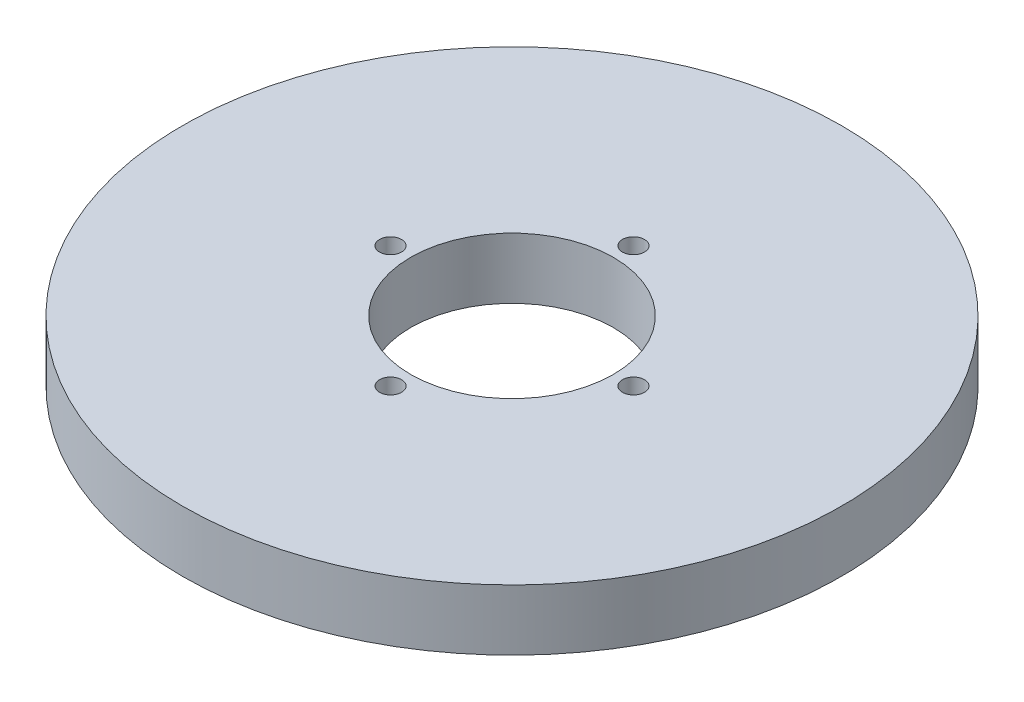
ISO-10303-21;
HEADER;
FILE_DESCRIPTION(('STEP AP214'),'2;1');
FILE_NAME('part.step','',(''),(''),'','','');
FILE_SCHEMA(('AUTOMOTIVE_DESIGN { 1 0 10303 214 1 1 1 1 }'));
ENDSEC;
DATA;
#1=APPLICATION_CONTEXT('core data for automotive mechanical design processes');
#2=APPLICATION_PROTOCOL_DEFINITION('international standard','automotive_design',2000,#1);
#3=PRODUCT_CONTEXT('',#1,'mechanical');
#4=PRODUCT('Part','Part','',(#3));
#5=PRODUCT_RELATED_PRODUCT_CATEGORY('part','',(#4));
#6=PRODUCT_DEFINITION_FORMATION('','',#4);
#7=PRODUCT_DEFINITION_CONTEXT('part definition',#1,'design');
#8=PRODUCT_DEFINITION('design','',#6,#7);
#9=PRODUCT_DEFINITION_SHAPE('','',#8);
#10=(LENGTH_UNIT() NAMED_UNIT(*) SI_UNIT(.MILLI.,.METRE.));
#11=(NAMED_UNIT(*) PLANE_ANGLE_UNIT() SI_UNIT($,.RADIAN.));
#12=(NAMED_UNIT(*) SI_UNIT($,.STERADIAN.) SOLID_ANGLE_UNIT());
#13=UNCERTAINTY_MEASURE_WITH_UNIT(LENGTH_MEASURE(1.E-05),#10,'distance_accuracy_value','');
#14=(GEOMETRIC_REPRESENTATION_CONTEXT(3) GLOBAL_UNCERTAINTY_ASSIGNED_CONTEXT((#13)) GLOBAL_UNIT_ASSIGNED_CONTEXT((#10,
#11,#12)) REPRESENTATION_CONTEXT('',''));
#15=CARTESIAN_POINT('',(0.,0.,0.));
#16=DIRECTION('',(0.,0.,1.));
#17=DIRECTION('',(1.,0.,0.));
#18=AXIS2_PLACEMENT_3D('',#15,#16,#17);
#19=CARTESIAN_POINT('',(0.,18.,0.));
#20=DIRECTION('',(0.,-1.,0.));
#21=DIRECTION('',(0.,0.,-1.));
#22=AXIS2_PLACEMENT_3D('',#19,#20,#21);
#23=CYLINDRICAL_SURFACE('',#22,97.5);
#24=CARTESIAN_POINT('',(0.,18.,0.));
#25=DIRECTION('',(0.,1.,0.));
#26=DIRECTION('',(0.,0.,1.));
#27=AXIS2_PLACEMENT_3D('',#24,#25,#26);
#28=CIRCLE('',#27,97.5);
#29=CARTESIAN_POINT('',(0.,18.,97.5));
#30=VERTEX_POINT('',#29);
#31=EDGE_CURVE('E10',#30,#30,#28,.T.);
#32=ORIENTED_EDGE('',*,*,#31,.F.);
#33=EDGE_LOOP('',(#32));
#34=FACE_BOUND('',#33,.T.);
#35=CARTESIAN_POINT('',(0.,0.,0.));
#36=DIRECTION('',(0.,1.,0.));
#37=DIRECTION('',(0.,0.,1.));
#38=AXIS2_PLACEMENT_3D('',#35,#36,#37);
#39=CIRCLE('',#38,97.5);
#40=CARTESIAN_POINT('',(0.,0.,97.5));
#41=VERTEX_POINT('',#40);
#42=EDGE_CURVE('E37',#41,#41,#39,.T.);
#43=ORIENTED_EDGE('',*,*,#42,.T.);
#44=EDGE_LOOP('',(#43));
#45=FACE_BOUND('',#44,.T.);
#46=ADVANCED_FACE('F40',(#34,#45),#23,.T.);
#47=CARTESIAN_POINT('',(0.,18.,0.));
#48=DIRECTION('',(0.,1.,0.));
#49=DIRECTION('',(0.,0.,1.));
#50=AXIS2_PLACEMENT_3D('',#47,#48,#49);
#51=PLANE('',#50);
#52=CARTESIAN_POINT('',(1.25469452952764E-13,18.,35.9358795812258));
#53=DIRECTION('',(0.,1.,0.));
#54=DIRECTION('',(1.,0.,0.));
#55=AXIS2_PLACEMENT_3D('',#52,#53,#54);
#56=CIRCLE('',#55,3.25439564108422);
#57=CARTESIAN_POINT('',(3.25439564108435,18.,35.9358795812258));
#58=VERTEX_POINT('',#57);
#59=EDGE_CURVE('E71',#58,#58,#56,.T.);
#60=ORIENTED_EDGE('',*,*,#59,.F.);
#61=EDGE_LOOP('',(#60));
#62=FACE_BOUND('',#61,.T.);
#63=CARTESIAN_POINT('',(35.9358795812258,18.,0.));
#64=DIRECTION('',(0.,1.,0.));
#65=DIRECTION('',(0.,0.,-1.));
#66=AXIS2_PLACEMENT_3D('',#63,#64,#65);
#67=CIRCLE('',#66,3.25439564108422);
#68=CARTESIAN_POINT('',(35.9358795812258,18.,-3.25439564108422));
#69=VERTEX_POINT('',#68);
#70=EDGE_CURVE('E70',#69,#69,#67,.T.);
#71=ORIENTED_EDGE('',*,*,#70,.F.);
#72=EDGE_LOOP('',(#71));
#73=FACE_BOUND('',#72,.T.);
#74=CARTESIAN_POINT('',(-3.76408358858292E-13,18.,-35.9358795812258));
#75=DIRECTION('',(0.,1.,0.));
#76=DIRECTION('',(-1.,0.,0.));
#77=AXIS2_PLACEMENT_3D('',#74,#75,#76);
#78=CIRCLE('',#77,3.25439564108422);
#79=CARTESIAN_POINT('',(-3.2543956410846,18.,-35.9358795812258));
#80=VERTEX_POINT('',#79);
#81=EDGE_CURVE('E61',#80,#80,#78,.T.);
#82=ORIENTED_EDGE('',*,*,#81,.F.);
#83=EDGE_LOOP('',(#82));
#84=FACE_BOUND('',#83,.T.);
#85=CARTESIAN_POINT('',(-35.9358795812258,18.,0.));
#86=DIRECTION('',(0.,1.,0.));
#87=DIRECTION('',(0.,0.,1.));
#88=AXIS2_PLACEMENT_3D('',#85,#86,#87);
#89=CIRCLE('',#88,3.25439564108422);
#90=CARTESIAN_POINT('',(-35.9358795812258,18.,3.25439564108422));
#91=VERTEX_POINT('',#90);
#92=EDGE_CURVE('E54',#91,#91,#89,.T.);
#93=ORIENTED_EDGE('',*,*,#92,.F.);
#94=EDGE_LOOP('',(#93));
#95=FACE_BOUND('',#94,.T.);
#96=CARTESIAN_POINT('',(0.,18.,0.));
#97=DIRECTION('',(0.,1.,0.));
#98=DIRECTION('',(0.,0.,1.));
#99=AXIS2_PLACEMENT_3D('',#96,#97,#98);
#100=CIRCLE('',#99,30.);
#101=CARTESIAN_POINT('',(0.,18.,30.));
#102=VERTEX_POINT('',#101);
#103=EDGE_CURVE('E50',#102,#102,#100,.T.);
#104=ORIENTED_EDGE('',*,*,#103,.F.);
#105=EDGE_LOOP('',(#104));
#106=FACE_BOUND('',#105,.T.);
#107=ORIENTED_EDGE('',*,*,#31,.T.);
#108=EDGE_LOOP('',(#107));
#109=FACE_BOUND('',#108,.T.);
#110=ADVANCED_FACE('F86',(#62,#73,#84,#95,#106,#109),#51,.T.);
#111=CARTESIAN_POINT('',(0.,0.,0.));
#112=DIRECTION('',(0.,1.,0.));
#113=DIRECTION('',(0.,0.,1.));
#114=AXIS2_PLACEMENT_3D('',#111,#112,#113);
#115=PLANE('',#114);
#116=CARTESIAN_POINT('',(0.,0.,0.));
#117=DIRECTION('',(0.,1.,0.));
#118=DIRECTION('',(0.,0.,1.));
#119=AXIS2_PLACEMENT_3D('',#116,#117,#118);
#120=CIRCLE('',#119,30.);
#121=CARTESIAN_POINT('',(0.,0.,30.));
#122=VERTEX_POINT('',#121);
#123=EDGE_CURVE('E47',#122,#122,#120,.T.);
#124=ORIENTED_EDGE('',*,*,#123,.T.);
#125=EDGE_LOOP('',(#124));
#126=FACE_BOUND('',#125,.T.);
#127=ORIENTED_EDGE('',*,*,#42,.F.);
#128=EDGE_LOOP('',(#127));
#129=FACE_BOUND('',#128,.T.);
#130=ADVANCED_FACE('F93',(#126,#129),#115,.F.);
#131=CARTESIAN_POINT('',(0.,18.,0.));
#132=DIRECTION('',(0.,-1.,0.));
#133=DIRECTION('',(0.,0.,-1.));
#134=AXIS2_PLACEMENT_3D('',#131,#132,#133);
#135=CYLINDRICAL_SURFACE('',#134,30.);
#136=ORIENTED_EDGE('',*,*,#103,.T.);
#137=EDGE_LOOP('',(#136));
#138=FACE_BOUND('',#137,.T.);
#139=ORIENTED_EDGE('',*,*,#123,.F.);
#140=EDGE_LOOP('',(#139));
#141=FACE_BOUND('',#140,.T.);
#142=ADVANCED_FACE('F101',(#138,#141),#135,.F.);
#143=CARTESIAN_POINT('',(-35.9358795812258,2.93724953424175,0.));
#144=DIRECTION('',(0.,1.,0.));
#145=DIRECTION('',(0.,0.,1.));
#146=AXIS2_PLACEMENT_3D('',#143,#144,#145);
#147=CYLINDRICAL_SURFACE('',#146,3.25439564108422);
#148=CARTESIAN_POINT('',(-35.9358795812258,2.93724953424175,0.));
#149=DIRECTION('',(0.,1.,0.));
#150=DIRECTION('',(0.,0.,1.));
#151=AXIS2_PLACEMENT_3D('',#148,#149,#150);
#152=CIRCLE('',#151,3.25439564108422);
#153=CARTESIAN_POINT('',(-35.9358795812258,2.93724953424175,3.25439564108422));
#154=VERTEX_POINT('',#153);
#155=EDGE_CURVE('E55',#154,#154,#152,.T.);
#156=ORIENTED_EDGE('',*,*,#155,.F.);
#157=EDGE_LOOP('',(#156));
#158=FACE_BOUND('',#157,.T.);
#159=ORIENTED_EDGE('',*,*,#92,.T.);
#160=EDGE_LOOP('',(#159));
#161=FACE_BOUND('',#160,.T.);
#162=ADVANCED_FACE('F102',(#158,#161),#147,.F.);
#163=CARTESIAN_POINT('',(-35.9358795812258,2.93724953424175,0.));
#164=DIRECTION('',(0.,1.,0.));
#165=DIRECTION('',(0.,0.,1.));
#166=AXIS2_PLACEMENT_3D('',#163,#164,#165);
#167=PLANE('',#166);
#168=ORIENTED_EDGE('',*,*,#155,.T.);
#169=EDGE_LOOP('',(#168));
#170=FACE_BOUND('',#169,.T.);
#171=ADVANCED_FACE('F133',(#170),#167,.T.);
#172=CARTESIAN_POINT('',(-3.76408358858292E-13,2.93724953424175,-35.9358795812258));
#173=DIRECTION('',(0.,1.,0.));
#174=DIRECTION('',(0.,0.,1.));
#175=AXIS2_PLACEMENT_3D('',#172,#173,#174);
#176=CYLINDRICAL_SURFACE('',#175,3.25439564108422);
#177=CARTESIAN_POINT('',(-3.76408358858292E-13,2.93724953424175,-35.9358795812258));
#178=DIRECTION('',(0.,1.,0.));
#179=DIRECTION('',(-1.,0.,0.));
#180=AXIS2_PLACEMENT_3D('',#177,#178,#179);
#181=CIRCLE('',#180,3.25439564108422);
#182=CARTESIAN_POINT('',(-3.2543956410846,2.93724953424175,-35.9358795812258));
#183=VERTEX_POINT('',#182);
#184=EDGE_CURVE('E63',#183,#183,#181,.T.);
#185=ORIENTED_EDGE('',*,*,#184,.F.);
#186=EDGE_LOOP('',(#185));
#187=FACE_BOUND('',#186,.T.);
#188=ORIENTED_EDGE('',*,*,#81,.T.);
#189=EDGE_LOOP('',(#188));
#190=FACE_BOUND('',#189,.T.);
#191=ADVANCED_FACE('F142',(#187,#190),#176,.F.);
#192=CARTESIAN_POINT('',(-3.76408358858292E-13,2.93724953424175,-35.9358795812258));
#193=DIRECTION('',(0.,1.,0.));
#194=DIRECTION('',(-1.,0.,0.));
#195=AXIS2_PLACEMENT_3D('',#192,#193,#194);
#196=PLANE('',#195);
#197=ORIENTED_EDGE('',*,*,#184,.T.);
#198=EDGE_LOOP('',(#197));
#199=FACE_BOUND('',#198,.T.);
#200=ADVANCED_FACE('F156',(#199),#196,.T.);
#201=CARTESIAN_POINT('',(35.9358795812258,2.93724953424175,0.));
#202=DIRECTION('',(0.,1.,0.));
#203=DIRECTION('',(0.,0.,1.));
#204=AXIS2_PLACEMENT_3D('',#201,#202,#203);
#205=CYLINDRICAL_SURFACE('',#204,3.25439564108422);
#206=CARTESIAN_POINT('',(35.9358795812258,2.93724953424175,0.));
#207=DIRECTION('',(0.,1.,0.));
#208=DIRECTION('',(0.,0.,-1.));
#209=AXIS2_PLACEMENT_3D('',#206,#207,#208);
#210=CIRCLE('',#209,3.25439564108422);
#211=CARTESIAN_POINT('',(35.9358795812258,2.93724953424175,-3.25439564108422));
#212=VERTEX_POINT('',#211);
#213=EDGE_CURVE('E69',#212,#212,#210,.T.);
#214=ORIENTED_EDGE('',*,*,#213,.F.);
#215=EDGE_LOOP('',(#214));
#216=FACE_BOUND('',#215,.T.);
#217=ORIENTED_EDGE('',*,*,#70,.T.);
#218=EDGE_LOOP('',(#217));
#219=FACE_BOUND('',#218,.T.);
#220=ADVANCED_FACE('F164',(#216,#219),#205,.F.);
#221=CARTESIAN_POINT('',(35.9358795812258,2.93724953424175,0.));
#222=DIRECTION('',(0.,1.,0.));
#223=DIRECTION('',(0.,0.,-1.));
#224=AXIS2_PLACEMENT_3D('',#221,#222,#223);
#225=PLANE('',#224);
#226=ORIENTED_EDGE('',*,*,#213,.T.);
#227=EDGE_LOOP('',(#226));
#228=FACE_BOUND('',#227,.T.);
#229=ADVANCED_FACE('F83',(#228),#225,.T.);
#230=CARTESIAN_POINT('',(1.25469452952764E-13,2.93724953424175,35.9358795812258));
#231=DIRECTION('',(0.,1.,0.));
#232=DIRECTION('',(0.,0.,1.));
#233=AXIS2_PLACEMENT_3D('',#230,#231,#232);
#234=CYLINDRICAL_SURFACE('',#233,3.25439564108422);
#235=CARTESIAN_POINT('',(1.25469452952764E-13,2.93724953424175,35.9358795812258));
#236=DIRECTION('',(0.,1.,0.));
#237=DIRECTION('',(1.,0.,0.));
#238=AXIS2_PLACEMENT_3D('',#235,#236,#237);
#239=CIRCLE('',#238,3.25439564108422);
#240=CARTESIAN_POINT('',(3.25439564108435,2.93724953424175,35.9358795812258));
#241=VERTEX_POINT('',#240);
#242=EDGE_CURVE('E59',#241,#241,#239,.T.);
#243=ORIENTED_EDGE('',*,*,#242,.F.);
#244=EDGE_LOOP('',(#243));
#245=FACE_BOUND('',#244,.T.);
#246=ORIENTED_EDGE('',*,*,#59,.T.);
#247=EDGE_LOOP('',(#246));
#248=FACE_BOUND('',#247,.T.);
#249=ADVANCED_FACE('F81',(#245,#248),#234,.F.);
#250=CARTESIAN_POINT('',(1.25469452952764E-13,2.93724953424175,35.9358795812258));
#251=DIRECTION('',(0.,1.,0.));
#252=DIRECTION('',(1.,0.,0.));
#253=AXIS2_PLACEMENT_3D('',#250,#251,#252);
#254=PLANE('',#253);
#255=ORIENTED_EDGE('',*,*,#242,.T.);
#256=EDGE_LOOP('',(#255));
#257=FACE_BOUND('',#256,.T.);
#258=ADVANCED_FACE('F78',(#257),#254,.T.);
#259=CLOSED_SHELL('',(#46,#110,#130,#142,#162,#171,#191,#200,#220,#229,#249,#258));
#260=MANIFOLD_SOLID_BREP('B2',#259);
#261=ADVANCED_BREP_SHAPE_REPRESENTATION('',(#18,#260),#14);
#262=SHAPE_DEFINITION_REPRESENTATION(#9,#261);
ENDSEC;
END-ISO-10303-21;
